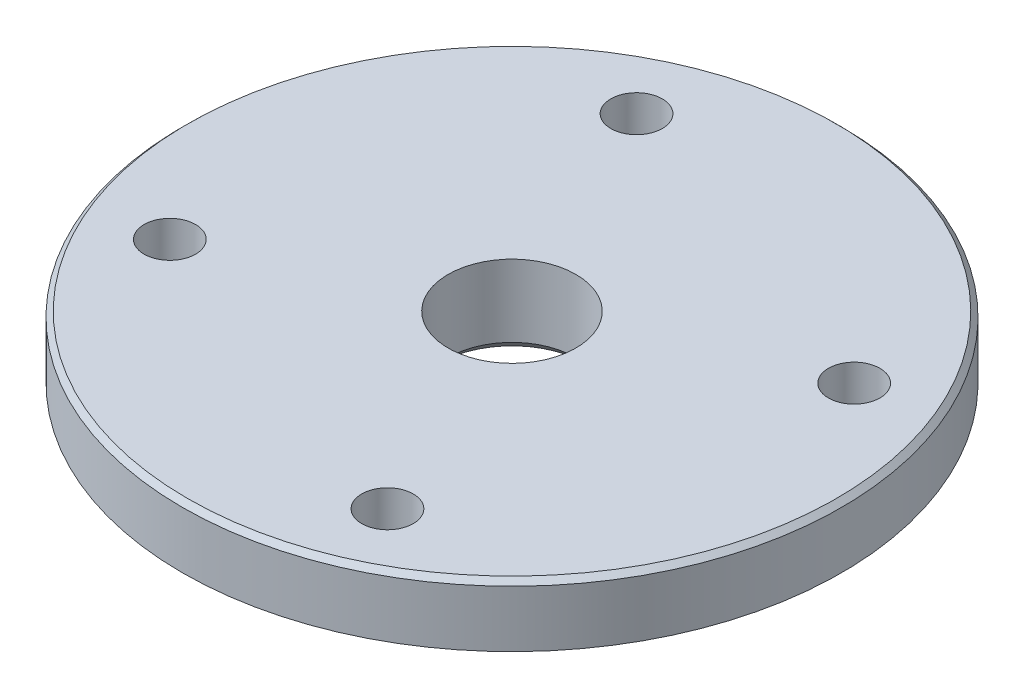
ISO-10303-21;
HEADER;
FILE_DESCRIPTION(('STEP AP214'),'2;1');
FILE_NAME('part.step','',(''),(''),'','','');
FILE_SCHEMA(('AUTOMOTIVE_DESIGN { 1 0 10303 214 1 1 1 1 }'));
ENDSEC;
DATA;
#1=APPLICATION_CONTEXT('core data for automotive mechanical design processes');
#2=APPLICATION_PROTOCOL_DEFINITION('international standard','automotive_design',2000,#1);
#3=PRODUCT_CONTEXT('',#1,'mechanical');
#4=PRODUCT('Part','Part','',(#3));
#5=PRODUCT_RELATED_PRODUCT_CATEGORY('part','',(#4));
#6=PRODUCT_DEFINITION_FORMATION('','',#4);
#7=PRODUCT_DEFINITION_CONTEXT('part definition',#1,'design');
#8=PRODUCT_DEFINITION('design','',#6,#7);
#9=PRODUCT_DEFINITION_SHAPE('','',#8);
#10=(LENGTH_UNIT() NAMED_UNIT(*) SI_UNIT(.MILLI.,.METRE.));
#11=(NAMED_UNIT(*) PLANE_ANGLE_UNIT() SI_UNIT($,.RADIAN.));
#12=(NAMED_UNIT(*) SI_UNIT($,.STERADIAN.) SOLID_ANGLE_UNIT());
#13=UNCERTAINTY_MEASURE_WITH_UNIT(LENGTH_MEASURE(1.E-05),#10,'distance_accuracy_value','');
#14=(GEOMETRIC_REPRESENTATION_CONTEXT(3) GLOBAL_UNCERTAINTY_ASSIGNED_CONTEXT((#13)) GLOBAL_UNIT_ASSIGNED_CONTEXT((#10,
#11,#12)) REPRESENTATION_CONTEXT('',''));
#15=CARTESIAN_POINT('',(0.,0.,0.));
#16=DIRECTION('',(0.,0.,1.));
#17=DIRECTION('',(1.,0.,0.));
#18=AXIS2_PLACEMENT_3D('',#15,#16,#17);
#19=CARTESIAN_POINT('',(16.,1.5,0.));
#20=DIRECTION('',(0.,1.,0.));
#21=DIRECTION('',(0.,0.,1.));
#22=AXIS2_PLACEMENT_3D('',#19,#20,#21);
#23=PLANE('',#22);
#24=CARTESIAN_POINT('',(0.,1.5,0.));
#25=DIRECTION('',(0.,1.,0.));
#26=DIRECTION('',(0.,0.,1.));
#27=AXIS2_PLACEMENT_3D('',#24,#25,#26);
#28=CIRCLE('',#27,15.75);
#29=CARTESIAN_POINT('',(0.,1.5,15.75));
#30=VERTEX_POINT('',#29);
#31=EDGE_CURVE('E46',#30,#30,#28,.T.);
#32=ORIENTED_EDGE('',*,*,#31,.T.);
#33=EDGE_LOOP('',(#32));
#34=FACE_BOUND('',#33,.T.);
#35=CARTESIAN_POINT('',(5.28272827175883,1.5,11.3288473379581));
#36=DIRECTION('',(0.,1.,0.));
#37=DIRECTION('',(0.,0.,1.));
#38=AXIS2_PLACEMENT_3D('',#35,#36,#37);
#39=CIRCLE('',#38,1.24999999999999);
#40=CARTESIAN_POINT('',(5.28272827175883,1.5,12.5788473379581));
#41=VERTEX_POINT('',#40);
#42=EDGE_CURVE('E94',#41,#41,#39,.T.);
#43=ORIENTED_EDGE('',*,*,#42,.F.);
#44=EDGE_LOOP('',(#43));
#45=FACE_BOUND('',#44,.T.);
#46=CARTESIAN_POINT('',(-11.3288473379581,1.5,5.28272827175871));
#47=DIRECTION('',(0.,1.,0.));
#48=DIRECTION('',(0.,0.,1.));
#49=AXIS2_PLACEMENT_3D('',#46,#47,#48);
#50=CIRCLE('',#49,1.24999999999999);
#51=CARTESIAN_POINT('',(-11.3288473379581,1.5,6.5327282717587));
#52=VERTEX_POINT('',#51);
#53=EDGE_CURVE('E88',#52,#52,#50,.T.);
#54=ORIENTED_EDGE('',*,*,#53,.F.);
#55=EDGE_LOOP('',(#54));
#56=FACE_BOUND('',#55,.T.);
#57=CARTESIAN_POINT('',(-5.28272827175875,1.5,-11.3288473379581));
#58=DIRECTION('',(0.,1.,0.));
#59=DIRECTION('',(0.,0.,1.));
#60=AXIS2_PLACEMENT_3D('',#57,#58,#59);
#61=CIRCLE('',#60,1.24999999999999);
#62=CARTESIAN_POINT('',(-5.28272827175875,1.5,-10.0788473379581));
#63=VERTEX_POINT('',#62);
#64=EDGE_CURVE('E82',#63,#63,#61,.T.);
#65=ORIENTED_EDGE('',*,*,#64,.F.);
#66=EDGE_LOOP('',(#65));
#67=FACE_BOUND('',#66,.T.);
#68=CARTESIAN_POINT('',(11.3288473379581,1.5,-5.28272827175871));
#69=DIRECTION('',(0.,1.,0.));
#70=DIRECTION('',(0.,0.,1.));
#71=AXIS2_PLACEMENT_3D('',#68,#69,#70);
#72=CIRCLE('',#71,1.24999999999999);
#73=CARTESIAN_POINT('',(11.3288473379581,1.5,-4.03272827175873));
#74=VERTEX_POINT('',#73);
#75=EDGE_CURVE('E76',#74,#74,#72,.T.);
#76=ORIENTED_EDGE('',*,*,#75,.F.);
#77=EDGE_LOOP('',(#76));
#78=FACE_BOUND('',#77,.T.);
#79=CARTESIAN_POINT('',(0.,1.5,0.));
#80=DIRECTION('',(0.,-1.,0.));
#81=DIRECTION('',(0.,0.,-1.));
#82=AXIS2_PLACEMENT_3D('',#79,#80,#81);
#83=CIRCLE('',#82,3.1);
#84=CARTESIAN_POINT('',(0.,1.5,-3.1));
#85=VERTEX_POINT('',#84);
#86=EDGE_CURVE('E67',#85,#85,#83,.T.);
#87=ORIENTED_EDGE('',*,*,#86,.T.);
#88=EDGE_LOOP('',(#87));
#89=FACE_BOUND('',#88,.T.);
#90=ADVANCED_FACE('F35',(#34,#45,#56,#67,#78,#89),#23,.T.);
#91=CARTESIAN_POINT('',(0.,0.,0.));
#92=DIRECTION('',(0.,-1.,0.));
#93=DIRECTION('',(0.,0.,-1.));
#94=AXIS2_PLACEMENT_3D('',#91,#92,#93);
#95=CYLINDRICAL_SURFACE('',#94,3.1);
#96=CARTESIAN_POINT('',(0.,-1.99999999999999,0.));
#97=DIRECTION('',(0.,-1.,0.));
#98=DIRECTION('',(0.,0.,-1.));
#99=AXIS2_PLACEMENT_3D('',#96,#97,#98);
#100=CIRCLE('',#99,3.1);
#101=CARTESIAN_POINT('',(0.,-1.99999999999999,-3.1));
#102=VERTEX_POINT('',#101);
#103=EDGE_CURVE('E64',#102,#102,#100,.T.);
#104=ORIENTED_EDGE('',*,*,#103,.T.);
#105=EDGE_LOOP('',(#104));
#106=FACE_BOUND('',#105,.T.);
#107=ORIENTED_EDGE('',*,*,#86,.F.);
#108=EDGE_LOOP('',(#107));
#109=FACE_BOUND('',#108,.T.);
#110=ADVANCED_FACE('F103',(#106,#109),#95,.F.);
#111=CARTESIAN_POINT('',(3.1,-2.5,0.));
#112=DIRECTION('',(0.,-1.,0.));
#113=DIRECTION('',(0.,0.,-1.));
#114=AXIS2_PLACEMENT_3D('',#111,#112,#113);
#115=PLANE('',#114);
#116=CARTESIAN_POINT('',(0.,-2.5,0.));
#117=DIRECTION('',(0.,-1.,0.));
#118=DIRECTION('',(0.,0.,-1.));
#119=AXIS2_PLACEMENT_3D('',#116,#117,#118);
#120=CIRCLE('',#119,8.8);
#121=CARTESIAN_POINT('',(0.,-2.5,-8.8));
#122=VERTEX_POINT('',#121);
#123=EDGE_CURVE('E58',#122,#122,#120,.T.);
#124=ORIENTED_EDGE('',*,*,#123,.T.);
#125=EDGE_LOOP('',(#124));
#126=FACE_BOUND('',#125,.T.);
#127=CARTESIAN_POINT('',(0.,-2.5,0.));
#128=DIRECTION('',(0.,-1.,0.));
#129=DIRECTION('',(0.,0.,-1.));
#130=AXIS2_PLACEMENT_3D('',#127,#128,#129);
#131=CIRCLE('',#130,3.60000000000001);
#132=CARTESIAN_POINT('',(0.,-2.5,-3.60000000000001));
#133=VERTEX_POINT('',#132);
#134=EDGE_CURVE('E61',#133,#133,#131,.F.);
#135=ORIENTED_EDGE('',*,*,#134,.T.);
#136=EDGE_LOOP('',(#135));
#137=FACE_BOUND('',#136,.T.);
#138=ADVANCED_FACE('F115',(#126,#137),#115,.T.);
#139=CARTESIAN_POINT('',(0.,0.,0.));
#140=DIRECTION('',(0.,-1.,0.));
#141=DIRECTION('',(0.,0.,-1.));
#142=AXIS2_PLACEMENT_3D('',#139,#140,#141);
#143=CYLINDRICAL_SURFACE('',#142,9.);
#144=CARTESIAN_POINT('',(0.,-1.7,0.));
#145=DIRECTION('',(0.,-1.,0.));
#146=DIRECTION('',(0.,0.,-1.));
#147=AXIS2_PLACEMENT_3D('',#144,#145,#146);
#148=CIRCLE('',#147,9.);
#149=CARTESIAN_POINT('',(0.,-1.7,-9.));
#150=VERTEX_POINT('',#149);
#151=EDGE_CURVE('E42',#150,#150,#148,.T.);
#152=ORIENTED_EDGE('',*,*,#151,.T.);
#153=EDGE_LOOP('',(#152));
#154=FACE_BOUND('',#153,.T.);
#155=CARTESIAN_POINT('',(0.,-2.3,0.));
#156=DIRECTION('',(0.,-1.,0.));
#157=DIRECTION('',(0.,0.,-1.));
#158=AXIS2_PLACEMENT_3D('',#155,#156,#157);
#159=CIRCLE('',#158,9.);
#160=CARTESIAN_POINT('',(0.,-2.3,-9.));
#161=VERTEX_POINT('',#160);
#162=EDGE_CURVE('E55',#161,#161,#159,.F.);
#163=ORIENTED_EDGE('',*,*,#162,.T.);
#164=EDGE_LOOP('',(#163));
#165=FACE_BOUND('',#164,.T.);
#166=ADVANCED_FACE('F121',(#154,#165),#143,.T.);
#167=CARTESIAN_POINT('',(9.,-1.5,0.));
#168=DIRECTION('',(0.,-1.,0.));
#169=DIRECTION('',(0.,0.,-1.));
#170=AXIS2_PLACEMENT_3D('',#167,#168,#169);
#171=PLANE('',#170);
#172=CARTESIAN_POINT('',(0.,-1.5,0.));
#173=DIRECTION('',(0.,-1.,0.));
#174=DIRECTION('',(0.,0.,-1.));
#175=AXIS2_PLACEMENT_3D('',#172,#173,#174);
#176=CIRCLE('',#175,9.2);
#177=CARTESIAN_POINT('',(0.,-1.5,-9.2));
#178=VERTEX_POINT('',#177);
#179=EDGE_CURVE('E10',#178,#178,#176,.F.);
#180=ORIENTED_EDGE('',*,*,#179,.T.);
#181=EDGE_LOOP('',(#180));
#182=FACE_BOUND('',#181,.T.);
#183=CARTESIAN_POINT('',(5.28272827175883,-1.5,11.3288473379581));
#184=DIRECTION('',(0.,-1.,0.));
#185=DIRECTION('',(0.,0.,-1.));
#186=AXIS2_PLACEMENT_3D('',#183,#184,#185);
#187=CIRCLE('',#186,1.24999999999999);
#188=CARTESIAN_POINT('',(5.28272827175883,-1.5,10.0788473379581));
#189=VERTEX_POINT('',#188);
#190=EDGE_CURVE('E91',#189,#189,#187,.T.);
#191=ORIENTED_EDGE('',*,*,#190,.F.);
#192=EDGE_LOOP('',(#191));
#193=FACE_BOUND('',#192,.T.);
#194=CARTESIAN_POINT('',(-11.3288473379581,-1.5,5.28272827175871));
#195=DIRECTION('',(0.,-1.,0.));
#196=DIRECTION('',(0.,0.,-1.));
#197=AXIS2_PLACEMENT_3D('',#194,#195,#196);
#198=CIRCLE('',#197,1.24999999999999);
#199=CARTESIAN_POINT('',(-11.3288473379581,-1.5,4.03272827175872));
#200=VERTEX_POINT('',#199);
#201=EDGE_CURVE('E85',#200,#200,#198,.T.);
#202=ORIENTED_EDGE('',*,*,#201,.F.);
#203=EDGE_LOOP('',(#202));
#204=FACE_BOUND('',#203,.T.);
#205=CARTESIAN_POINT('',(-5.28272827175875,-1.5,-11.3288473379581));
#206=DIRECTION('',(0.,-1.,0.));
#207=DIRECTION('',(0.,0.,-1.));
#208=AXIS2_PLACEMENT_3D('',#205,#206,#207);
#209=CIRCLE('',#208,1.24999999999999);
#210=CARTESIAN_POINT('',(-5.28272827175875,-1.5,-12.5788473379581));
#211=VERTEX_POINT('',#210);
#212=EDGE_CURVE('E79',#211,#211,#209,.T.);
#213=ORIENTED_EDGE('',*,*,#212,.F.);
#214=EDGE_LOOP('',(#213));
#215=FACE_BOUND('',#214,.T.);
#216=CARTESIAN_POINT('',(11.3288473379581,-1.5,-5.28272827175871));
#217=DIRECTION('',(0.,-1.,0.));
#218=DIRECTION('',(0.,0.,-1.));
#219=AXIS2_PLACEMENT_3D('',#216,#217,#218);
#220=CIRCLE('',#219,1.24999999999999);
#221=CARTESIAN_POINT('',(11.3288473379581,-1.5,-6.53272827175871));
#222=VERTEX_POINT('',#221);
#223=EDGE_CURVE('E73',#222,#222,#220,.T.);
#224=ORIENTED_EDGE('',*,*,#223,.F.);
#225=EDGE_LOOP('',(#224));
#226=FACE_BOUND('',#225,.T.);
#227=CARTESIAN_POINT('',(0.,-1.5,0.));
#228=DIRECTION('',(0.,-1.,0.));
#229=DIRECTION('',(0.,0.,-1.));
#230=AXIS2_PLACEMENT_3D('',#227,#228,#229);
#231=CIRCLE('',#230,16.);
#232=CARTESIAN_POINT('',(0.,-1.5,-16.));
#233=VERTEX_POINT('',#232);
#234=EDGE_CURVE('E70',#233,#233,#231,.T.);
#235=ORIENTED_EDGE('',*,*,#234,.T.);
#236=EDGE_LOOP('',(#235));
#237=FACE_BOUND('',#236,.T.);
#238=ADVANCED_FACE('F148',(#182,#193,#204,#215,#226,#237),#171,.T.);
#239=CARTESIAN_POINT('',(0.,0.,0.));
#240=DIRECTION('',(0.,-1.,0.));
#241=DIRECTION('',(0.,0.,-1.));
#242=AXIS2_PLACEMENT_3D('',#239,#240,#241);
#243=CYLINDRICAL_SURFACE('',#242,16.);
#244=CARTESIAN_POINT('',(0.,1.25,0.));
#245=DIRECTION('',(0.,1.,0.));
#246=DIRECTION('',(0.,0.,1.));
#247=AXIS2_PLACEMENT_3D('',#244,#245,#246);
#248=CIRCLE('',#247,16.);
#249=CARTESIAN_POINT('',(0.,1.25,16.));
#250=VERTEX_POINT('',#249);
#251=EDGE_CURVE('E50',#250,#250,#248,.F.);
#252=ORIENTED_EDGE('',*,*,#251,.T.);
#253=EDGE_LOOP('',(#252));
#254=FACE_BOUND('',#253,.T.);
#255=ORIENTED_EDGE('',*,*,#234,.F.);
#256=EDGE_LOOP('',(#255));
#257=FACE_BOUND('',#256,.T.);
#258=ADVANCED_FACE('F130',(#254,#257),#243,.T.);
#259=CARTESIAN_POINT('',(0.,-1.99999999999999,0.));
#260=DIRECTION('',(0.,-1.,0.));
#261=DIRECTION('',(0.,0.,-1.));
#262=AXIS2_PLACEMENT_3D('',#259,#260,#261);
#263=CONICAL_SURFACE('',#262,3.1,0.785398163397445);
#264=ORIENTED_EDGE('',*,*,#134,.F.);
#265=EDGE_LOOP('',(#264));
#266=FACE_BOUND('',#265,.T.);
#267=ORIENTED_EDGE('',*,*,#103,.F.);
#268=EDGE_LOOP('',(#267));
#269=FACE_BOUND('',#268,.T.);
#270=ADVANCED_FACE('F126',(#266,#269),#263,.F.);
#271=CARTESIAN_POINT('',(11.3288473379581,1.5,-5.28272827175871));
#272=DIRECTION('',(0.,1.,0.));
#273=DIRECTION('',(0.,0.,1.));
#274=AXIS2_PLACEMENT_3D('',#271,#272,#273);
#275=CYLINDRICAL_SURFACE('',#274,1.24999999999999);
#276=ORIENTED_EDGE('',*,*,#75,.T.);
#277=EDGE_LOOP('',(#276));
#278=FACE_BOUND('',#277,.T.);
#279=ORIENTED_EDGE('',*,*,#223,.T.);
#280=EDGE_LOOP('',(#279));
#281=FACE_BOUND('',#280,.T.);
#282=ADVANCED_FACE('F129',(#278,#281),#275,.F.);
#283=CARTESIAN_POINT('',(-5.28272827175875,1.5,-11.3288473379581));
#284=DIRECTION('',(0.,1.,0.));
#285=DIRECTION('',(0.,0.,1.));
#286=AXIS2_PLACEMENT_3D('',#283,#284,#285);
#287=CYLINDRICAL_SURFACE('',#286,1.24999999999999);
#288=ORIENTED_EDGE('',*,*,#64,.T.);
#289=EDGE_LOOP('',(#288));
#290=FACE_BOUND('',#289,.T.);
#291=ORIENTED_EDGE('',*,*,#212,.T.);
#292=EDGE_LOOP('',(#291));
#293=FACE_BOUND('',#292,.T.);
#294=ADVANCED_FACE('F161',(#290,#293),#287,.F.);
#295=CARTESIAN_POINT('',(-11.3288473379581,1.5,5.28272827175871));
#296=DIRECTION('',(0.,1.,0.));
#297=DIRECTION('',(0.,0.,1.));
#298=AXIS2_PLACEMENT_3D('',#295,#296,#297);
#299=CYLINDRICAL_SURFACE('',#298,1.24999999999999);
#300=ORIENTED_EDGE('',*,*,#53,.T.);
#301=EDGE_LOOP('',(#300));
#302=FACE_BOUND('',#301,.T.);
#303=ORIENTED_EDGE('',*,*,#201,.T.);
#304=EDGE_LOOP('',(#303));
#305=FACE_BOUND('',#304,.T.);
#306=ADVANCED_FACE('F165',(#302,#305),#299,.F.);
#307=CARTESIAN_POINT('',(5.28272827175883,1.5,11.3288473379581));
#308=DIRECTION('',(0.,1.,0.));
#309=DIRECTION('',(0.,0.,1.));
#310=AXIS2_PLACEMENT_3D('',#307,#308,#309);
#311=CYLINDRICAL_SURFACE('',#310,1.24999999999999);
#312=ORIENTED_EDGE('',*,*,#42,.T.);
#313=EDGE_LOOP('',(#312));
#314=FACE_BOUND('',#313,.T.);
#315=ORIENTED_EDGE('',*,*,#190,.T.);
#316=EDGE_LOOP('',(#315));
#317=FACE_BOUND('',#316,.T.);
#318=ADVANCED_FACE('F98',(#314,#317),#311,.F.);
#319=CARTESIAN_POINT('',(0.,-2.5,0.));
#320=DIRECTION('',(0.,1.,0.));
#321=DIRECTION('',(0.,0.,1.));
#322=AXIS2_PLACEMENT_3D('',#319,#320,#321);
#323=CONICAL_SURFACE('',#322,8.8,0.785398163397457);
#324=ORIENTED_EDGE('',*,*,#162,.F.);
#325=EDGE_LOOP('',(#324));
#326=FACE_BOUND('',#325,.T.);
#327=ORIENTED_EDGE('',*,*,#123,.F.);
#328=EDGE_LOOP('',(#327));
#329=FACE_BOUND('',#328,.T.);
#330=ADVANCED_FACE('F132',(#326,#329),#323,.T.);
#331=CARTESIAN_POINT('',(0.,1.25,0.));
#332=DIRECTION('',(0.,-1.,0.));
#333=DIRECTION('',(0.,0.,-1.));
#334=AXIS2_PLACEMENT_3D('',#331,#332,#333);
#335=CONICAL_SURFACE('',#334,16.,0.785398163397455);
#336=ORIENTED_EDGE('',*,*,#31,.F.);
#337=EDGE_LOOP('',(#336));
#338=FACE_BOUND('',#337,.T.);
#339=ORIENTED_EDGE('',*,*,#251,.F.);
#340=EDGE_LOOP('',(#339));
#341=FACE_BOUND('',#340,.T.);
#342=ADVANCED_FACE('F134',(#338,#341),#335,.T.);
#343=CARTESIAN_POINT('',(0.,-1.7,0.));
#344=DIRECTION('',(0.,-1.,0.));
#345=DIRECTION('',(0.,0.,-1.));
#346=AXIS2_PLACEMENT_3D('',#343,#344,#345);
#347=TOROIDAL_SURFACE('',#346,9.2,0.2);
#348=ORIENTED_EDGE('',*,*,#179,.F.);
#349=EDGE_LOOP('',(#348));
#350=FACE_BOUND('',#349,.T.);
#351=ORIENTED_EDGE('',*,*,#151,.F.);
#352=EDGE_LOOP('',(#351));
#353=FACE_BOUND('',#352,.T.);
#354=ADVANCED_FACE('F37',(#350,#353),#347,.F.);
#355=CLOSED_SHELL('',(#90,#110,#138,#166,#238,#258,#270,#282,#294,#306,#318,#330,#342,#354));
#356=MANIFOLD_SOLID_BREP('B2',#355);
#357=ADVANCED_BREP_SHAPE_REPRESENTATION('',(#18,#356),#14);
#358=SHAPE_DEFINITION_REPRESENTATION(#9,#357);
ENDSEC;
END-ISO-10303-21;
